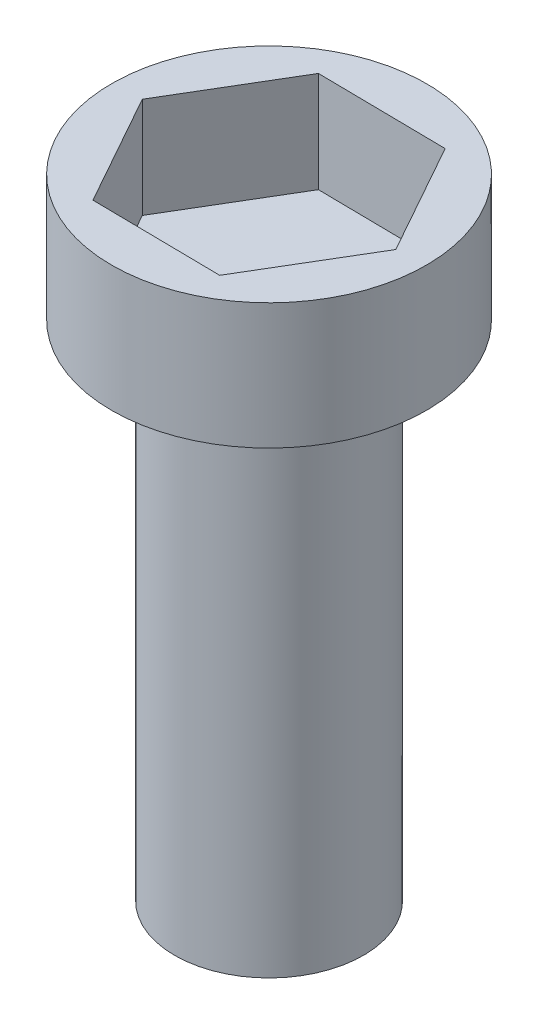
ISO-10303-21;
HEADER;
FILE_DESCRIPTION(('STEP AP214'),'2;1');
FILE_NAME('part.step','',(''),(''),'','','');
FILE_SCHEMA(('AUTOMOTIVE_DESIGN { 1 0 10303 214 1 1 1 1 }'));
ENDSEC;
DATA;
#1=APPLICATION_CONTEXT('core data for automotive mechanical design processes');
#2=APPLICATION_PROTOCOL_DEFINITION('international standard','automotive_design',2000,#1);
#3=PRODUCT_CONTEXT('',#1,'mechanical');
#4=PRODUCT('Part','Part','',(#3));
#5=PRODUCT_RELATED_PRODUCT_CATEGORY('part','',(#4));
#6=PRODUCT_DEFINITION_FORMATION('','',#4);
#7=PRODUCT_DEFINITION_CONTEXT('part definition',#1,'design');
#8=PRODUCT_DEFINITION('design','',#6,#7);
#9=PRODUCT_DEFINITION_SHAPE('','',#8);
#10=(LENGTH_UNIT() NAMED_UNIT(*) SI_UNIT(.MILLI.,.METRE.));
#11=(NAMED_UNIT(*) PLANE_ANGLE_UNIT() SI_UNIT($,.RADIAN.));
#12=(NAMED_UNIT(*) SI_UNIT($,.STERADIAN.) SOLID_ANGLE_UNIT());
#13=UNCERTAINTY_MEASURE_WITH_UNIT(LENGTH_MEASURE(1.E-05),#10,'distance_accuracy_value','');
#14=(GEOMETRIC_REPRESENTATION_CONTEXT(3) GLOBAL_UNCERTAINTY_ASSIGNED_CONTEXT((#13)) GLOBAL_UNIT_ASSIGNED_CONTEXT((#10,
#11,#12)) REPRESENTATION_CONTEXT('',''));
#15=CARTESIAN_POINT('',(0.,0.,0.));
#16=DIRECTION('',(0.,0.,1.));
#17=DIRECTION('',(1.,0.,0.));
#18=AXIS2_PLACEMENT_3D('',#15,#16,#17);
#19=CARTESIAN_POINT('',(0.,8.,0.));
#20=DIRECTION('',(0.,-1.,0.));
#21=DIRECTION('',(0.,0.,-1.));
#22=AXIS2_PLACEMENT_3D('',#19,#20,#21);
#23=CYLINDRICAL_SURFACE('',#22,1.5);
#24=CARTESIAN_POINT('',(0.,8.,0.));
#25=DIRECTION('',(0.,1.,0.));
#26=DIRECTION('',(0.,0.,1.));
#27=AXIS2_PLACEMENT_3D('',#24,#25,#26);
#28=CIRCLE('',#27,1.5);
#29=CARTESIAN_POINT('',(0.,8.,1.5));
#30=VERTEX_POINT('',#29);
#31=EDGE_CURVE('E11',#30,#30,#28,.T.);
#32=ORIENTED_EDGE('',*,*,#31,.F.);
#33=EDGE_LOOP('',(#32));
#34=FACE_BOUND('',#33,.T.);
#35=CARTESIAN_POINT('',(0.,0.,0.));
#36=DIRECTION('',(0.,1.,0.));
#37=DIRECTION('',(0.,0.,1.));
#38=AXIS2_PLACEMENT_3D('',#35,#36,#37);
#39=CIRCLE('',#38,1.5);
#40=CARTESIAN_POINT('',(0.,0.,1.5));
#41=VERTEX_POINT('',#40);
#42=EDGE_CURVE('E46',#41,#41,#39,.T.);
#43=ORIENTED_EDGE('',*,*,#42,.T.);
#44=EDGE_LOOP('',(#43));
#45=FACE_BOUND('',#44,.T.);
#46=ADVANCED_FACE('F43',(#34,#45),#23,.T.);
#47=CARTESIAN_POINT('',(0.,0.,0.));
#48=DIRECTION('',(0.,1.,0.));
#49=DIRECTION('',(0.,0.,1.));
#50=AXIS2_PLACEMENT_3D('',#47,#48,#49);
#51=PLANE('',#50);
#52=ORIENTED_EDGE('',*,*,#42,.F.);
#53=EDGE_LOOP('',(#52));
#54=FACE_BOUND('',#53,.T.);
#55=ADVANCED_FACE('F193',(#54),#51,.F.);
#56=CARTESIAN_POINT('',(0.,10.,0.));
#57=DIRECTION('',(0.,-1.,0.));
#58=DIRECTION('',(0.,0.,-1.));
#59=AXIS2_PLACEMENT_3D('',#56,#57,#58);
#60=CYLINDRICAL_SURFACE('',#59,2.5);
#61=CARTESIAN_POINT('',(0.,10.,0.));
#62=DIRECTION('',(0.,1.,0.));
#63=DIRECTION('',(0.,0.,1.));
#64=AXIS2_PLACEMENT_3D('',#61,#62,#63);
#65=CIRCLE('',#64,2.5);
#66=CARTESIAN_POINT('',(0.,10.,2.5));
#67=VERTEX_POINT('',#66);
#68=EDGE_CURVE('E167',#67,#67,#65,.T.);
#69=ORIENTED_EDGE('',*,*,#68,.F.);
#70=EDGE_LOOP('',(#69));
#71=FACE_BOUND('',#70,.T.);
#72=CARTESIAN_POINT('',(0.,8.,0.));
#73=DIRECTION('',(0.,1.,0.));
#74=DIRECTION('',(0.,0.,1.));
#75=AXIS2_PLACEMENT_3D('',#72,#73,#74);
#76=CIRCLE('',#75,2.5);
#77=CARTESIAN_POINT('',(0.,8.,2.5));
#78=VERTEX_POINT('',#77);
#79=EDGE_CURVE('E157',#78,#78,#76,.T.);
#80=ORIENTED_EDGE('',*,*,#79,.T.);
#81=EDGE_LOOP('',(#80));
#82=FACE_BOUND('',#81,.T.);
#83=ADVANCED_FACE('F175',(#71,#82),#60,.T.);
#84=CARTESIAN_POINT('',(0.,10.,0.));
#85=DIRECTION('',(0.,1.,0.));
#86=DIRECTION('',(0.,0.,1.));
#87=AXIS2_PLACEMENT_3D('',#84,#85,#86);
#88=PLANE('',#87);
#89=DIRECTION('',(0.999910905466136,0.,0.013348450467837));
#90=VECTOR('',#89,1.);
#91=CARTESIAN_POINT('',(-1.04431865035052,10.,1.75430812493096));
#92=LINE('',#91,#90);
#93=CARTESIAN_POINT('',(-1.04431865035052,10.,1.75430812493096));
#94=VERTEX_POINT('',#93);
#95=CARTESIAN_POINT('',(0.997116077080399,10.,1.78156054331491));
#96=VERTEX_POINT('',#95);
#97=EDGE_CURVE('E58',#94,#96,#92,.T.);
#98=ORIENTED_EDGE('',*,*,#97,.F.);
#99=DIRECTION('',(0.488395355526763,0.,0.872622470888692));
#100=VECTOR('',#99,1.);
#101=CARTESIAN_POINT('',(-2.04143472743092,10.,-0.0272524183839453));
#102=LINE('',#101,#100);
#103=CARTESIAN_POINT('',(-2.04143472743092,10.,-0.0272524183839453));
#104=VERTEX_POINT('',#103);
#105=EDGE_CURVE('E151',#104,#94,#102,.T.);
#106=ORIENTED_EDGE('',*,*,#105,.F.);
#107=DIRECTION('',(-0.511515549939372,0.,0.859274020420856));
#108=VECTOR('',#107,1.);
#109=CARTESIAN_POINT('',(-0.9971160770804,10.,-1.78156054331491));
#110=LINE('',#109,#108);
#111=CARTESIAN_POINT('',(-0.9971160770804,10.,-1.78156054331491));
#112=VERTEX_POINT('',#111);
#113=EDGE_CURVE('E148',#112,#104,#110,.T.);
#114=ORIENTED_EDGE('',*,*,#113,.F.);
#115=DIRECTION('',(-0.999910905466136,0.,-0.0133484504678369));
#116=VECTOR('',#115,1.);
#117=CARTESIAN_POINT('',(1.04431865035052,10.,-1.75430812493096));
#118=LINE('',#117,#116);
#119=CARTESIAN_POINT('',(1.04431865035052,10.,-1.75430812493096));
#120=VERTEX_POINT('',#119);
#121=EDGE_CURVE('E106',#120,#112,#118,.T.);
#122=ORIENTED_EDGE('',*,*,#121,.F.);
#123=DIRECTION('',(-0.488395355526763,0.,-0.872622470888692));
#124=VECTOR('',#123,1.);
#125=CARTESIAN_POINT('',(2.04143472743092,10.,0.027252418383946));
#126=LINE('',#125,#124);
#127=CARTESIAN_POINT('',(2.04143472743092,10.,0.027252418383946));
#128=VERTEX_POINT('',#127);
#129=EDGE_CURVE('E142',#128,#120,#126,.T.);
#130=ORIENTED_EDGE('',*,*,#129,.F.);
#131=DIRECTION('',(0.511515549939373,0.,-0.859274020420856));
#132=VECTOR('',#131,1.);
#133=CARTESIAN_POINT('',(0.997116077080399,10.,1.78156054331491));
#134=LINE('',#133,#132);
#135=EDGE_CURVE('E138',#96,#128,#134,.T.);
#136=ORIENTED_EDGE('',*,*,#135,.F.);
#137=EDGE_LOOP('',(#98,#106,#114,#122,#130,#136));
#138=FACE_BOUND('',#137,.T.);
#139=ORIENTED_EDGE('',*,*,#68,.T.);
#140=EDGE_LOOP('',(#139));
#141=FACE_BOUND('',#140,.T.);
#142=ADVANCED_FACE('F180',(#138,#141),#88,.T.);
#143=CARTESIAN_POINT('',(0.,8.,0.));
#144=DIRECTION('',(0.,1.,0.));
#145=DIRECTION('',(0.,0.,1.));
#146=AXIS2_PLACEMENT_3D('',#143,#144,#145);
#147=PLANE('',#146);
#148=ORIENTED_EDGE('',*,*,#31,.T.);
#149=EDGE_LOOP('',(#148));
#150=FACE_BOUND('',#149,.T.);
#151=ORIENTED_EDGE('',*,*,#79,.F.);
#152=EDGE_LOOP('',(#151));
#153=FACE_BOUND('',#152,.T.);
#154=ADVANCED_FACE('F177',(#150,#153),#147,.F.);
#155=CARTESIAN_POINT('',(-1.04431865035052,8.4,1.75430812493096));
#156=DIRECTION('',(-0.013348450467837,0.,0.999910905466136));
#157=DIRECTION('',(0.999910905466136,0.,0.013348450467837));
#158=AXIS2_PLACEMENT_3D('',#155,#156,#157);
#159=PLANE('',#158);
#160=ORIENTED_EDGE('',*,*,#97,.T.);
#161=DIRECTION('',(0.,1.,0.));
#162=VECTOR('',#161,1.);
#163=CARTESIAN_POINT('',(0.997116077080399,8.4,1.78156054331491));
#164=LINE('',#163,#162);
#165=CARTESIAN_POINT('',(0.997116077080399,8.4,1.78156054331491));
#166=VERTEX_POINT('',#165);
#167=EDGE_CURVE('E88',#166,#96,#164,.T.);
#168=ORIENTED_EDGE('',*,*,#167,.F.);
#169=DIRECTION('',(0.999910905466136,0.,0.013348450467837));
#170=VECTOR('',#169,1.);
#171=CARTESIAN_POINT('',(-1.04431865035052,8.4,1.75430812493096));
#172=LINE('',#171,#170);
#173=CARTESIAN_POINT('',(-1.04431865035052,8.4,1.75430812493096));
#174=VERTEX_POINT('',#173);
#175=EDGE_CURVE('E154',#174,#166,#172,.T.);
#176=ORIENTED_EDGE('',*,*,#175,.F.);
#177=DIRECTION('',(0.,1.,0.));
#178=VECTOR('',#177,1.);
#179=CARTESIAN_POINT('',(-1.04431865035052,8.4,1.75430812493096));
#180=LINE('',#179,#178);
#181=EDGE_CURVE('E66',#174,#94,#180,.T.);
#182=ORIENTED_EDGE('',*,*,#181,.T.);
#183=EDGE_LOOP('',(#160,#168,#176,#182));
#184=FACE_BOUND('',#183,.T.);
#185=ADVANCED_FACE('F179',(#184),#159,.F.);
#186=CARTESIAN_POINT('',(-2.04143472743092,8.4,-0.0272524183839453));
#187=DIRECTION('',(-0.872622470888692,0.,0.488395355526763));
#188=DIRECTION('',(0.488395355526763,0.,0.872622470888692));
#189=AXIS2_PLACEMENT_3D('',#186,#187,#188);
#190=PLANE('',#189);
#191=ORIENTED_EDGE('',*,*,#105,.T.);
#192=ORIENTED_EDGE('',*,*,#181,.F.);
#193=DIRECTION('',(0.488395355526763,0.,0.872622470888692));
#194=VECTOR('',#193,1.);
#195=CARTESIAN_POINT('',(-2.04143472743092,8.4,-0.0272524183839453));
#196=LINE('',#195,#194);
#197=CARTESIAN_POINT('',(-2.04143472743092,8.4,-0.0272524183839453));
#198=VERTEX_POINT('',#197);
#199=EDGE_CURVE('E120',#198,#174,#196,.T.);
#200=ORIENTED_EDGE('',*,*,#199,.F.);
#201=DIRECTION('',(0.,1.,0.));
#202=VECTOR('',#201,1.);
#203=CARTESIAN_POINT('',(-2.04143472743092,8.4,-0.0272524183839453));
#204=LINE('',#203,#202);
#205=EDGE_CURVE('E111',#198,#104,#204,.T.);
#206=ORIENTED_EDGE('',*,*,#205,.T.);
#207=EDGE_LOOP('',(#191,#192,#200,#206));
#208=FACE_BOUND('',#207,.T.);
#209=ADVANCED_FACE('F187',(#208),#190,.F.);
#210=CARTESIAN_POINT('',(-0.9971160770804,8.4,-1.78156054331491));
#211=DIRECTION('',(-0.859274020420856,0.,-0.511515549939372));
#212=DIRECTION('',(-0.511515549939372,0.,0.859274020420856));
#213=AXIS2_PLACEMENT_3D('',#210,#211,#212);
#214=PLANE('',#213);
#215=ORIENTED_EDGE('',*,*,#113,.T.);
#216=ORIENTED_EDGE('',*,*,#205,.F.);
#217=DIRECTION('',(-0.511515549939372,0.,0.859274020420856));
#218=VECTOR('',#217,1.);
#219=CARTESIAN_POINT('',(-0.9971160770804,8.4,-1.78156054331491));
#220=LINE('',#219,#218);
#221=CARTESIAN_POINT('',(-0.9971160770804,8.4,-1.78156054331491));
#222=VERTEX_POINT('',#221);
#223=EDGE_CURVE('E115',#222,#198,#220,.T.);
#224=ORIENTED_EDGE('',*,*,#223,.F.);
#225=DIRECTION('',(0.,1.,0.));
#226=VECTOR('',#225,1.);
#227=CARTESIAN_POINT('',(-0.9971160770804,8.4,-1.78156054331491));
#228=LINE('',#227,#226);
#229=EDGE_CURVE('E99',#222,#112,#228,.T.);
#230=ORIENTED_EDGE('',*,*,#229,.T.);
#231=EDGE_LOOP('',(#215,#216,#224,#230));
#232=FACE_BOUND('',#231,.T.);
#233=ADVANCED_FACE('F116',(#232),#214,.F.);
#234=CARTESIAN_POINT('',(1.04431865035052,8.4,-1.75430812493096));
#235=DIRECTION('',(0.0133484504678369,0.,-0.999910905466136));
#236=DIRECTION('',(-0.999910905466136,0.,-0.0133484504678369));
#237=AXIS2_PLACEMENT_3D('',#234,#235,#236);
#238=PLANE('',#237);
#239=ORIENTED_EDGE('',*,*,#121,.T.);
#240=ORIENTED_EDGE('',*,*,#229,.F.);
#241=DIRECTION('',(-0.999910905466136,0.,-0.0133484504678369));
#242=VECTOR('',#241,1.);
#243=CARTESIAN_POINT('',(1.04431865035052,8.4,-1.75430812493096));
#244=LINE('',#243,#242);
#245=CARTESIAN_POINT('',(1.04431865035052,8.4,-1.75430812493096));
#246=VERTEX_POINT('',#245);
#247=EDGE_CURVE('E103',#246,#222,#244,.T.);
#248=ORIENTED_EDGE('',*,*,#247,.F.);
#249=DIRECTION('',(0.,1.,0.));
#250=VECTOR('',#249,1.);
#251=CARTESIAN_POINT('',(1.04431865035052,8.4,-1.75430812493096));
#252=LINE('',#251,#250);
#253=EDGE_CURVE('E112',#246,#120,#252,.T.);
#254=ORIENTED_EDGE('',*,*,#253,.T.);
#255=EDGE_LOOP('',(#239,#240,#248,#254));
#256=FACE_BOUND('',#255,.T.);
#257=ADVANCED_FACE('F101',(#256),#238,.F.);
#258=CARTESIAN_POINT('',(2.04143472743092,8.4,0.027252418383946));
#259=DIRECTION('',(0.872622470888692,0.,-0.488395355526763));
#260=DIRECTION('',(-0.488395355526763,0.,-0.872622470888693));
#261=AXIS2_PLACEMENT_3D('',#258,#259,#260);
#262=PLANE('',#261);
#263=ORIENTED_EDGE('',*,*,#129,.T.);
#264=ORIENTED_EDGE('',*,*,#253,.F.);
#265=DIRECTION('',(-0.488395355526763,0.,-0.872622470888692));
#266=VECTOR('',#265,1.);
#267=CARTESIAN_POINT('',(2.04143472743092,8.4,0.027252418383946));
#268=LINE('',#267,#266);
#269=CARTESIAN_POINT('',(2.04143472743092,8.4,0.027252418383946));
#270=VERTEX_POINT('',#269);
#271=EDGE_CURVE('E126',#270,#246,#268,.T.);
#272=ORIENTED_EDGE('',*,*,#271,.F.);
#273=DIRECTION('',(0.,1.,0.));
#274=VECTOR('',#273,1.);
#275=CARTESIAN_POINT('',(2.04143472743092,8.4,0.027252418383946));
#276=LINE('',#275,#274);
#277=EDGE_CURVE('E162',#270,#128,#276,.T.);
#278=ORIENTED_EDGE('',*,*,#277,.T.);
#279=EDGE_LOOP('',(#263,#264,#272,#278));
#280=FACE_BOUND('',#279,.T.);
#281=ADVANCED_FACE('F253',(#280),#262,.F.);
#282=CARTESIAN_POINT('',(0.997116077080399,8.4,1.78156054331491));
#283=DIRECTION('',(0.859274020420856,0.,0.511515549939373));
#284=DIRECTION('',(0.511515549939373,0.,-0.859274020420856));
#285=AXIS2_PLACEMENT_3D('',#282,#283,#284);
#286=PLANE('',#285);
#287=ORIENTED_EDGE('',*,*,#135,.T.);
#288=ORIENTED_EDGE('',*,*,#277,.F.);
#289=DIRECTION('',(0.511515549939373,0.,-0.859274020420856));
#290=VECTOR('',#289,1.);
#291=CARTESIAN_POINT('',(0.997116077080399,8.4,1.78156054331491));
#292=LINE('',#291,#290);
#293=EDGE_CURVE('E130',#166,#270,#292,.T.);
#294=ORIENTED_EDGE('',*,*,#293,.F.);
#295=ORIENTED_EDGE('',*,*,#167,.T.);
#296=EDGE_LOOP('',(#287,#288,#294,#295));
#297=FACE_BOUND('',#296,.T.);
#298=ADVANCED_FACE('F263',(#297),#286,.F.);
#299=CARTESIAN_POINT('',(0.,8.4,0.));
#300=DIRECTION('',(0.,1.,0.));
#301=DIRECTION('',(0.,0.,1.));
#302=AXIS2_PLACEMENT_3D('',#299,#300,#301);
#303=PLANE('',#302);
#304=ORIENTED_EDGE('',*,*,#175,.T.);
#305=ORIENTED_EDGE('',*,*,#293,.T.);
#306=ORIENTED_EDGE('',*,*,#271,.T.);
#307=ORIENTED_EDGE('',*,*,#247,.T.);
#308=ORIENTED_EDGE('',*,*,#223,.T.);
#309=ORIENTED_EDGE('',*,*,#199,.T.);
#310=EDGE_LOOP('',(#304,#305,#306,#307,#308,#309));
#311=FACE_BOUND('',#310,.T.);
#312=ADVANCED_FACE('F123',(#311),#303,.T.);
#313=CLOSED_SHELL('',(#46,#55,#83,#142,#154,#185,#209,#233,#257,#281,#298,#312));
#314=MANIFOLD_SOLID_BREP('B2',#313);
#315=ADVANCED_BREP_SHAPE_REPRESENTATION('',(#18,#314),#14);
#316=SHAPE_DEFINITION_REPRESENTATION(#9,#315);
ENDSEC;
END-ISO-10303-21;
